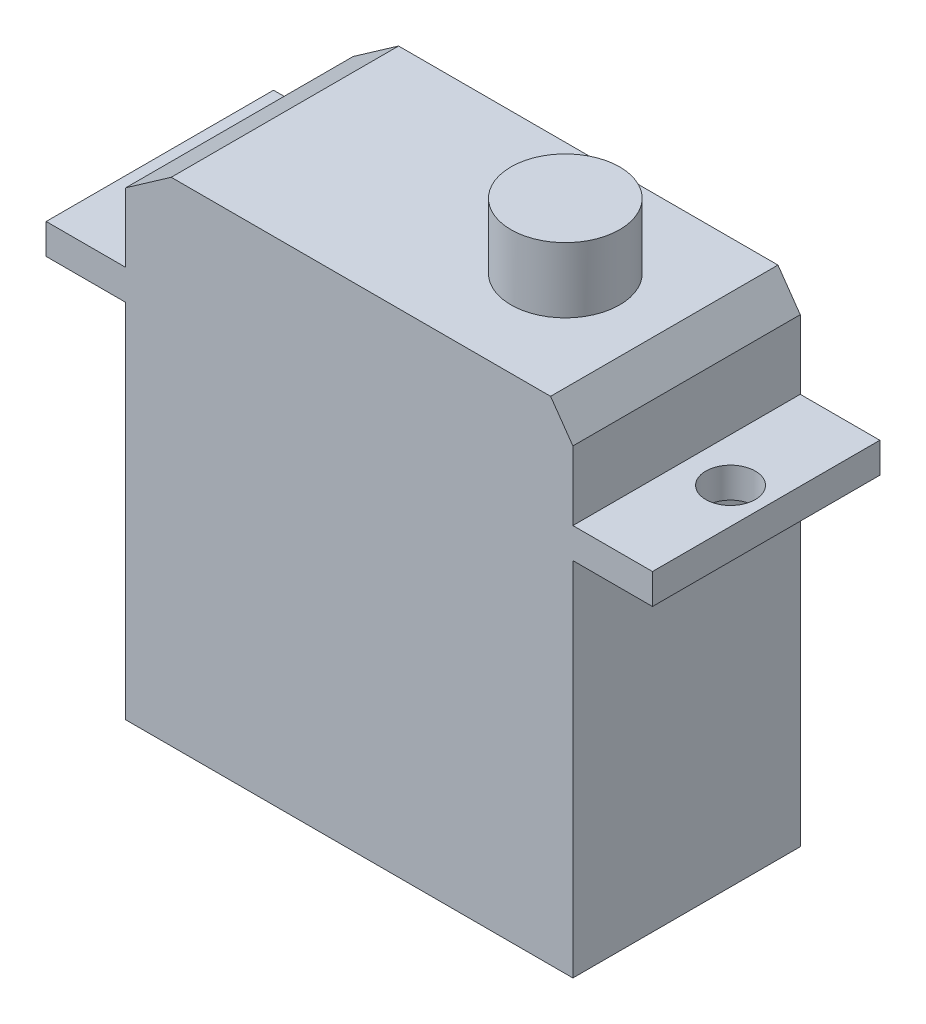
ISO-10303-21;
HEADER;
FILE_DESCRIPTION(('STEP AP214'),'2;1');
FILE_NAME('part.step','',(''),(''),'','','');
FILE_SCHEMA(('AUTOMOTIVE_DESIGN { 1 0 10303 214 1 1 1 1 }'));
ENDSEC;
DATA;
#1=APPLICATION_CONTEXT('core data for automotive mechanical design processes');
#2=APPLICATION_PROTOCOL_DEFINITION('international standard','automotive_design',2000,#1);
#3=PRODUCT_CONTEXT('',#1,'mechanical');
#4=PRODUCT('Part','Part','',(#3));
#5=PRODUCT_RELATED_PRODUCT_CATEGORY('part','',(#4));
#6=PRODUCT_DEFINITION_FORMATION('','',#4);
#7=PRODUCT_DEFINITION_CONTEXT('part definition',#1,'design');
#8=PRODUCT_DEFINITION('design','',#6,#7);
#9=PRODUCT_DEFINITION_SHAPE('','',#8);
#10=(LENGTH_UNIT() NAMED_UNIT(*) SI_UNIT(.MILLI.,.METRE.));
#11=(NAMED_UNIT(*) PLANE_ANGLE_UNIT() SI_UNIT($,.RADIAN.));
#12=(NAMED_UNIT(*) SI_UNIT($,.STERADIAN.) SOLID_ANGLE_UNIT());
#13=UNCERTAINTY_MEASURE_WITH_UNIT(LENGTH_MEASURE(1.E-05),#10,'distance_accuracy_value','');
#14=(GEOMETRIC_REPRESENTATION_CONTEXT(3) GLOBAL_UNCERTAINTY_ASSIGNED_CONTEXT((#13)) GLOBAL_UNIT_ASSIGNED_CONTEXT((#10,
#11,#12)) REPRESENTATION_CONTEXT('',''));
#15=CARTESIAN_POINT('',(0.,0.,0.));
#16=DIRECTION('',(0.,0.,1.));
#17=DIRECTION('',(1.,0.,0.));
#18=AXIS2_PLACEMENT_3D('',#15,#16,#17);
#19=CARTESIAN_POINT('',(20.,11.925,7.5));
#20=DIRECTION('',(0.,1.,0.));
#21=DIRECTION('',(0.,0.,1.));
#22=AXIS2_PLACEMENT_3D('',#19,#20,#21);
#23=PLANE('',#22);
#24=CARTESIAN_POINT('',(17.65,11.925,0.));
#25=DIRECTION('',(0.,1.,0.));
#26=DIRECTION('',(0.,0.,1.));
#27=AXIS2_PLACEMENT_3D('',#24,#25,#26);
#28=CIRCLE('',#27,1.63195);
#29=CARTESIAN_POINT('',(17.65,11.925,1.63194999999999));
#30=VERTEX_POINT('',#29);
#31=EDGE_CURVE('E313',#30,#30,#28,.T.);
#32=ORIENTED_EDGE('',*,*,#31,.T.);
#33=EDGE_LOOP('',(#32));
#34=FACE_BOUND('',#33,.T.);
#35=DIRECTION('',(1.,0.,0.));
#36=VECTOR('',#35,1.);
#37=CARTESIAN_POINT('',(20.,11.925,-7.5));
#38=LINE('',#37,#36);
#39=CARTESIAN_POINT('',(14.75,11.925,-7.5));
#40=VERTEX_POINT('',#39);
#41=CARTESIAN_POINT('',(20.,11.925,-7.5));
#42=VERTEX_POINT('',#41);
#43=EDGE_CURVE('E172',#40,#42,#38,.T.);
#44=ORIENTED_EDGE('',*,*,#43,.T.);
#45=DIRECTION('',(0.,0.,-1.));
#46=VECTOR('',#45,1.);
#47=CARTESIAN_POINT('',(20.,11.925,7.5));
#48=LINE('',#47,#46);
#49=CARTESIAN_POINT('',(20.,11.925,7.5));
#50=VERTEX_POINT('',#49);
#51=EDGE_CURVE('E47',#50,#42,#48,.T.);
#52=ORIENTED_EDGE('',*,*,#51,.F.);
#53=DIRECTION('',(1.,0.,0.));
#54=VECTOR('',#53,1.);
#55=CARTESIAN_POINT('',(20.,11.925,7.5));
#56=LINE('',#55,#54);
#57=CARTESIAN_POINT('',(14.75,11.925,7.5));
#58=VERTEX_POINT('',#57);
#59=EDGE_CURVE('E199',#58,#50,#56,.T.);
#60=ORIENTED_EDGE('',*,*,#59,.F.);
#61=DIRECTION('',(0.,0.,-1.));
#62=VECTOR('',#61,1.);
#63=CARTESIAN_POINT('',(14.75,11.925,7.5));
#64=LINE('',#63,#62);
#65=EDGE_CURVE('E168',#58,#40,#64,.T.);
#66=ORIENTED_EDGE('',*,*,#65,.T.);
#67=EDGE_LOOP('',(#44,#52,#60,#66));
#68=FACE_BOUND('',#67,.T.);
#69=ADVANCED_FACE('F38',(#34,#68),#23,.F.);
#70=CARTESIAN_POINT('',(20.,13.925,7.5));
#71=DIRECTION('',(-1.,0.,0.));
#72=DIRECTION('',(0.,0.,1.));
#73=AXIS2_PLACEMENT_3D('',#70,#71,#72);
#74=PLANE('',#73);
#75=DIRECTION('',(0.,1.,0.));
#76=VECTOR('',#75,1.);
#77=CARTESIAN_POINT('',(20.,13.925,-7.5));
#78=LINE('',#77,#76);
#79=CARTESIAN_POINT('',(20.,13.925,-7.5));
#80=VERTEX_POINT('',#79);
#81=EDGE_CURVE('E175',#42,#80,#78,.T.);
#82=ORIENTED_EDGE('',*,*,#81,.T.);
#83=DIRECTION('',(0.,0.,-1.));
#84=VECTOR('',#83,1.);
#85=CARTESIAN_POINT('',(20.,13.925,7.5));
#86=LINE('',#85,#84);
#87=CARTESIAN_POINT('',(20.,13.925,7.5));
#88=VERTEX_POINT('',#87);
#89=EDGE_CURVE('E227',#88,#80,#86,.T.);
#90=ORIENTED_EDGE('',*,*,#89,.F.);
#91=DIRECTION('',(0.,1.,0.));
#92=VECTOR('',#91,1.);
#93=CARTESIAN_POINT('',(20.,13.925,7.5));
#94=LINE('',#93,#92);
#95=EDGE_CURVE('E117',#50,#88,#94,.T.);
#96=ORIENTED_EDGE('',*,*,#95,.F.);
#97=ORIENTED_EDGE('',*,*,#51,.T.);
#98=EDGE_LOOP('',(#82,#90,#96,#97));
#99=FACE_BOUND('',#98,.T.);
#100=ADVANCED_FACE('F231',(#99),#74,.F.);
#101=CARTESIAN_POINT('',(14.75,13.925,7.5));
#102=DIRECTION('',(0.,-1.,0.));
#103=DIRECTION('',(0.,0.,-1.));
#104=AXIS2_PLACEMENT_3D('',#101,#102,#103);
#105=PLANE('',#104);
#106=CARTESIAN_POINT('',(17.65,13.925,0.));
#107=DIRECTION('',(0.,1.,0.));
#108=DIRECTION('',(0.,0.,1.));
#109=AXIS2_PLACEMENT_3D('',#106,#107,#108);
#110=CIRCLE('',#109,1.63195);
#111=CARTESIAN_POINT('',(17.65,13.925,1.63194999999999));
#112=VERTEX_POINT('',#111);
#113=EDGE_CURVE('E315',#112,#112,#110,.T.);
#114=ORIENTED_EDGE('',*,*,#113,.F.);
#115=EDGE_LOOP('',(#114));
#116=FACE_BOUND('',#115,.T.);
#117=DIRECTION('',(-1.,0.,0.));
#118=VECTOR('',#117,1.);
#119=CARTESIAN_POINT('',(14.75,13.925,-7.5));
#120=LINE('',#119,#118);
#121=CARTESIAN_POINT('',(14.75,13.925,-7.5));
#122=VERTEX_POINT('',#121);
#123=EDGE_CURVE('E178',#80,#122,#120,.T.);
#124=ORIENTED_EDGE('',*,*,#123,.T.);
#125=DIRECTION('',(0.,0.,-1.));
#126=VECTOR('',#125,1.);
#127=CARTESIAN_POINT('',(14.75,13.925,7.5));
#128=LINE('',#127,#126);
#129=CARTESIAN_POINT('',(14.75,13.925,7.5));
#130=VERTEX_POINT('',#129);
#131=EDGE_CURVE('E224',#130,#122,#128,.T.);
#132=ORIENTED_EDGE('',*,*,#131,.F.);
#133=DIRECTION('',(-1.,0.,0.));
#134=VECTOR('',#133,1.);
#135=CARTESIAN_POINT('',(14.75,13.925,7.5));
#136=LINE('',#135,#134);
#137=EDGE_CURVE('E251',#88,#130,#136,.T.);
#138=ORIENTED_EDGE('',*,*,#137,.F.);
#139=ORIENTED_EDGE('',*,*,#89,.T.);
#140=EDGE_LOOP('',(#124,#132,#138,#139));
#141=FACE_BOUND('',#140,.T.);
#142=ADVANCED_FACE('F242',(#116,#141),#105,.F.);
#143=CARTESIAN_POINT('',(14.75,18.4743773853709,7.5));
#144=DIRECTION('',(-1.,0.,0.));
#145=DIRECTION('',(0.,0.,1.));
#146=AXIS2_PLACEMENT_3D('',#143,#144,#145);
#147=PLANE('',#146);
#148=DIRECTION('',(0.,1.,0.));
#149=VECTOR('',#148,1.);
#150=CARTESIAN_POINT('',(14.75,18.4743773853709,-7.5));
#151=LINE('',#150,#149);
#152=CARTESIAN_POINT('',(14.75,18.4743773853709,-7.5));
#153=VERTEX_POINT('',#152);
#154=EDGE_CURVE('E180',#122,#153,#151,.T.);
#155=ORIENTED_EDGE('',*,*,#154,.T.);
#156=DIRECTION('',(0.,0.,-1.));
#157=VECTOR('',#156,1.);
#158=CARTESIAN_POINT('',(14.75,18.4743773853709,7.5));
#159=LINE('',#158,#157);
#160=CARTESIAN_POINT('',(14.75,18.4743773853709,7.5));
#161=VERTEX_POINT('',#160);
#162=EDGE_CURVE('E221',#161,#153,#159,.T.);
#163=ORIENTED_EDGE('',*,*,#162,.F.);
#164=DIRECTION('',(0.,1.,0.));
#165=VECTOR('',#164,1.);
#166=CARTESIAN_POINT('',(14.75,18.4743773853709,7.5));
#167=LINE('',#166,#165);
#168=EDGE_CURVE('E248',#130,#161,#167,.T.);
#169=ORIENTED_EDGE('',*,*,#168,.F.);
#170=ORIENTED_EDGE('',*,*,#131,.T.);
#171=EDGE_LOOP('',(#155,#163,#169,#170));
#172=FACE_BOUND('',#171,.T.);
#173=ADVANCED_FACE('F246',(#172),#147,.F.);
#174=CARTESIAN_POINT('',(13.2791282103029,20.575,7.5));
#175=DIRECTION('',(-0.819152044288992,-0.573576436351045,0.));
#176=DIRECTION('',(0.573576436351045,-0.819152044288993,0.));
#177=AXIS2_PLACEMENT_3D('',#174,#175,#176);
#178=PLANE('',#177);
#179=DIRECTION('',(-0.573576436351045,0.819152044288992,0.));
#180=VECTOR('',#179,1.);
#181=CARTESIAN_POINT('',(13.2791282103029,20.575,-7.5));
#182=LINE('',#181,#180);
#183=CARTESIAN_POINT('',(13.2791282103029,20.575,-7.5));
#184=VERTEX_POINT('',#183);
#185=EDGE_CURVE('E182',#153,#184,#182,.T.);
#186=ORIENTED_EDGE('',*,*,#185,.T.);
#187=DIRECTION('',(0.,0.,-1.));
#188=VECTOR('',#187,1.);
#189=CARTESIAN_POINT('',(13.2791282103029,20.575,7.5));
#190=LINE('',#189,#188);
#191=CARTESIAN_POINT('',(13.2791282103029,20.575,7.5));
#192=VERTEX_POINT('',#191);
#193=EDGE_CURVE('E218',#192,#184,#190,.T.);
#194=ORIENTED_EDGE('',*,*,#193,.F.);
#195=DIRECTION('',(-0.573576436351045,0.819152044288992,0.));
#196=VECTOR('',#195,1.);
#197=CARTESIAN_POINT('',(13.2791282103029,20.575,7.5));
#198=LINE('',#197,#196);
#199=EDGE_CURVE('E250',#161,#192,#198,.T.);
#200=ORIENTED_EDGE('',*,*,#199,.F.);
#201=ORIENTED_EDGE('',*,*,#162,.T.);
#202=EDGE_LOOP('',(#186,#194,#200,#201));
#203=FACE_BOUND('',#202,.T.);
#204=ADVANCED_FACE('F296',(#203),#178,.F.);
#205=CARTESIAN_POINT('',(-11.75,20.575,7.5));
#206=DIRECTION('',(0.,-1.,0.));
#207=DIRECTION('',(0.,0.,-1.));
#208=AXIS2_PLACEMENT_3D('',#205,#206,#207);
#209=PLANE('',#208);
#210=CARTESIAN_POINT('',(6.75000000000001,20.575,0.));
#211=DIRECTION('',(0.,-1.,0.));
#212=DIRECTION('',(0.,0.,-1.));
#213=AXIS2_PLACEMENT_3D('',#210,#211,#212);
#214=CIRCLE('',#213,3.587141306582);
#215=CARTESIAN_POINT('',(6.75000000000001,20.575,-3.587141306582));
#216=VERTEX_POINT('',#215);
#217=EDGE_CURVE('E11',#216,#216,#214,.F.);
#218=ORIENTED_EDGE('',*,*,#217,.F.);
#219=EDGE_LOOP('',(#218));
#220=FACE_BOUND('',#219,.T.);
#221=DIRECTION('',(-1.,0.,0.));
#222=VECTOR('',#221,1.);
#223=CARTESIAN_POINT('',(-11.75,20.575,-7.5));
#224=LINE('',#223,#222);
#225=CARTESIAN_POINT('',(-11.75,20.575,-7.5));
#226=VERTEX_POINT('',#225);
#227=EDGE_CURVE('E184',#184,#226,#224,.T.);
#228=ORIENTED_EDGE('',*,*,#227,.T.);
#229=DIRECTION('',(0.,0.,-1.));
#230=VECTOR('',#229,1.);
#231=CARTESIAN_POINT('',(-11.75,20.575,7.5));
#232=LINE('',#231,#230);
#233=CARTESIAN_POINT('',(-11.75,20.575,7.5));
#234=VERTEX_POINT('',#233);
#235=EDGE_CURVE('E215',#234,#226,#232,.T.);
#236=ORIENTED_EDGE('',*,*,#235,.F.);
#237=DIRECTION('',(-1.,0.,0.));
#238=VECTOR('',#237,1.);
#239=CARTESIAN_POINT('',(-11.75,20.575,7.5));
#240=LINE('',#239,#238);
#241=EDGE_CURVE('E253',#192,#234,#240,.T.);
#242=ORIENTED_EDGE('',*,*,#241,.F.);
#243=ORIENTED_EDGE('',*,*,#193,.T.);
#244=EDGE_LOOP('',(#228,#236,#242,#243));
#245=FACE_BOUND('',#244,.T.);
#246=ADVANCED_FACE('F292',(#220,#245),#209,.F.);
#247=CARTESIAN_POINT('',(-14.75,18.4743773853709,7.5));
#248=DIRECTION('',(0.573576436351045,-0.819152044288992,0.));
#249=DIRECTION('',(0.819152044288993,0.573576436351045,0.));
#250=AXIS2_PLACEMENT_3D('',#247,#248,#249);
#251=PLANE('',#250);
#252=DIRECTION('',(-0.819152044288992,-0.573576436351045,0.));
#253=VECTOR('',#252,1.);
#254=CARTESIAN_POINT('',(-14.75,18.4743773853709,-7.5));
#255=LINE('',#254,#253);
#256=CARTESIAN_POINT('',(-14.75,18.4743773853709,-7.5));
#257=VERTEX_POINT('',#256);
#258=EDGE_CURVE('E186',#226,#257,#255,.T.);
#259=ORIENTED_EDGE('',*,*,#258,.T.);
#260=DIRECTION('',(0.,0.,-1.));
#261=VECTOR('',#260,1.);
#262=CARTESIAN_POINT('',(-14.75,18.4743773853709,7.5));
#263=LINE('',#262,#261);
#264=CARTESIAN_POINT('',(-14.75,18.4743773853709,7.5));
#265=VERTEX_POINT('',#264);
#266=EDGE_CURVE('E212',#265,#257,#263,.T.);
#267=ORIENTED_EDGE('',*,*,#266,.F.);
#268=DIRECTION('',(-0.819152044288992,-0.573576436351045,0.));
#269=VECTOR('',#268,1.);
#270=CARTESIAN_POINT('',(-14.75,18.4743773853709,7.5));
#271=LINE('',#270,#269);
#272=EDGE_CURVE('E259',#234,#265,#271,.T.);
#273=ORIENTED_EDGE('',*,*,#272,.F.);
#274=ORIENTED_EDGE('',*,*,#235,.T.);
#275=EDGE_LOOP('',(#259,#267,#273,#274));
#276=FACE_BOUND('',#275,.T.);
#277=ADVANCED_FACE('F288',(#276),#251,.F.);
#278=CARTESIAN_POINT('',(-14.75,13.925,7.5));
#279=DIRECTION('',(1.,0.,0.));
#280=DIRECTION('',(0.,0.,-1.));
#281=AXIS2_PLACEMENT_3D('',#278,#279,#280);
#282=PLANE('',#281);
#283=DIRECTION('',(0.,-1.,0.));
#284=VECTOR('',#283,1.);
#285=CARTESIAN_POINT('',(-14.75,13.925,-7.5));
#286=LINE('',#285,#284);
#287=CARTESIAN_POINT('',(-14.75,13.925,-7.5));
#288=VERTEX_POINT('',#287);
#289=EDGE_CURVE('E188',#257,#288,#286,.T.);
#290=ORIENTED_EDGE('',*,*,#289,.T.);
#291=DIRECTION('',(0.,0.,-1.));
#292=VECTOR('',#291,1.);
#293=CARTESIAN_POINT('',(-14.75,13.925,7.5));
#294=LINE('',#293,#292);
#295=CARTESIAN_POINT('',(-14.75,13.925,7.5));
#296=VERTEX_POINT('',#295);
#297=EDGE_CURVE('E209',#296,#288,#294,.T.);
#298=ORIENTED_EDGE('',*,*,#297,.F.);
#299=DIRECTION('',(0.,-1.,0.));
#300=VECTOR('',#299,1.);
#301=CARTESIAN_POINT('',(-14.75,13.925,7.5));
#302=LINE('',#301,#300);
#303=EDGE_CURVE('E261',#265,#296,#302,.T.);
#304=ORIENTED_EDGE('',*,*,#303,.F.);
#305=ORIENTED_EDGE('',*,*,#266,.T.);
#306=EDGE_LOOP('',(#290,#298,#304,#305));
#307=FACE_BOUND('',#306,.T.);
#308=ADVANCED_FACE('F284',(#307),#282,.F.);
#309=CARTESIAN_POINT('',(-20.,13.925,7.5));
#310=DIRECTION('',(0.,-1.,0.));
#311=DIRECTION('',(0.,0.,-1.));
#312=AXIS2_PLACEMENT_3D('',#309,#310,#311);
#313=PLANE('',#312);
#314=CARTESIAN_POINT('',(-17.65,13.925,0.));
#315=DIRECTION('',(0.,1.,0.));
#316=DIRECTION('',(0.,0.,1.));
#317=AXIS2_PLACEMENT_3D('',#314,#315,#316);
#318=CIRCLE('',#317,1.63195);
#319=CARTESIAN_POINT('',(-17.65,13.925,1.63195));
#320=VERTEX_POINT('',#319);
#321=EDGE_CURVE('E323',#320,#320,#318,.T.);
#322=ORIENTED_EDGE('',*,*,#321,.F.);
#323=EDGE_LOOP('',(#322));
#324=FACE_BOUND('',#323,.T.);
#325=DIRECTION('',(-1.,0.,0.));
#326=VECTOR('',#325,1.);
#327=CARTESIAN_POINT('',(-20.,13.925,-7.5));
#328=LINE('',#327,#326);
#329=CARTESIAN_POINT('',(-20.,13.925,-7.5));
#330=VERTEX_POINT('',#329);
#331=EDGE_CURVE('E190',#288,#330,#328,.T.);
#332=ORIENTED_EDGE('',*,*,#331,.T.);
#333=DIRECTION('',(0.,0.,-1.));
#334=VECTOR('',#333,1.);
#335=CARTESIAN_POINT('',(-20.,13.925,7.5));
#336=LINE('',#335,#334);
#337=CARTESIAN_POINT('',(-20.,13.925,7.5));
#338=VERTEX_POINT('',#337);
#339=EDGE_CURVE('E206',#338,#330,#336,.T.);
#340=ORIENTED_EDGE('',*,*,#339,.F.);
#341=DIRECTION('',(-1.,0.,0.));
#342=VECTOR('',#341,1.);
#343=CARTESIAN_POINT('',(-20.,13.925,7.5));
#344=LINE('',#343,#342);
#345=EDGE_CURVE('E263',#296,#338,#344,.T.);
#346=ORIENTED_EDGE('',*,*,#345,.F.);
#347=ORIENTED_EDGE('',*,*,#297,.T.);
#348=EDGE_LOOP('',(#332,#340,#346,#347));
#349=FACE_BOUND('',#348,.T.);
#350=ADVANCED_FACE('F280',(#324,#349),#313,.F.);
#351=CARTESIAN_POINT('',(-20.,11.925,7.5));
#352=DIRECTION('',(1.,0.,0.));
#353=DIRECTION('',(0.,0.,-1.));
#354=AXIS2_PLACEMENT_3D('',#351,#352,#353);
#355=PLANE('',#354);
#356=DIRECTION('',(0.,-1.,0.));
#357=VECTOR('',#356,1.);
#358=CARTESIAN_POINT('',(-20.,11.925,-7.5));
#359=LINE('',#358,#357);
#360=CARTESIAN_POINT('',(-20.,11.925,-7.5));
#361=VERTEX_POINT('',#360);
#362=EDGE_CURVE('E192',#330,#361,#359,.T.);
#363=ORIENTED_EDGE('',*,*,#362,.T.);
#364=DIRECTION('',(0.,0.,-1.));
#365=VECTOR('',#364,1.);
#366=CARTESIAN_POINT('',(-20.,11.925,7.5));
#367=LINE('',#366,#365);
#368=CARTESIAN_POINT('',(-20.,11.925,7.5));
#369=VERTEX_POINT('',#368);
#370=EDGE_CURVE('E203',#369,#361,#367,.T.);
#371=ORIENTED_EDGE('',*,*,#370,.F.);
#372=DIRECTION('',(0.,-1.,0.));
#373=VECTOR('',#372,1.);
#374=CARTESIAN_POINT('',(-20.,11.925,7.5));
#375=LINE('',#374,#373);
#376=EDGE_CURVE('E265',#338,#369,#375,.T.);
#377=ORIENTED_EDGE('',*,*,#376,.F.);
#378=ORIENTED_EDGE('',*,*,#339,.T.);
#379=EDGE_LOOP('',(#363,#371,#377,#378));
#380=FACE_BOUND('',#379,.T.);
#381=ADVANCED_FACE('F271',(#380),#355,.F.);
#382=CARTESIAN_POINT('',(-14.75,11.925,7.5));
#383=DIRECTION('',(0.,1.,0.));
#384=DIRECTION('',(-1.,0.,0.));
#385=AXIS2_PLACEMENT_3D('',#382,#383,#384);
#386=PLANE('',#385);
#387=CARTESIAN_POINT('',(-17.65,11.925,0.));
#388=DIRECTION('',(0.,1.,0.));
#389=DIRECTION('',(-1.,0.,0.));
#390=AXIS2_PLACEMENT_3D('',#387,#388,#389);
#391=CIRCLE('',#390,1.63195);
#392=CARTESIAN_POINT('',(-19.28195,11.925,0.));
#393=VERTEX_POINT('',#392);
#394=EDGE_CURVE('E41',#393,#393,#391,.T.);
#395=ORIENTED_EDGE('',*,*,#394,.T.);
#396=EDGE_LOOP('',(#395));
#397=FACE_BOUND('',#396,.T.);
#398=DIRECTION('',(1.,0.,0.));
#399=VECTOR('',#398,1.);
#400=CARTESIAN_POINT('',(-14.75,11.925,-7.5));
#401=LINE('',#400,#399);
#402=CARTESIAN_POINT('',(-14.75,11.925,-7.5));
#403=VERTEX_POINT('',#402);
#404=EDGE_CURVE('E194',#361,#403,#401,.T.);
#405=ORIENTED_EDGE('',*,*,#404,.T.);
#406=DIRECTION('',(0.,0.,-1.));
#407=VECTOR('',#406,1.);
#408=CARTESIAN_POINT('',(-14.75,11.925,7.5));
#409=LINE('',#408,#407);
#410=CARTESIAN_POINT('',(-14.75,11.925,7.5));
#411=VERTEX_POINT('',#410);
#412=EDGE_CURVE('E163',#411,#403,#409,.T.);
#413=ORIENTED_EDGE('',*,*,#412,.F.);
#414=DIRECTION('',(1.,0.,0.));
#415=VECTOR('',#414,1.);
#416=CARTESIAN_POINT('',(-14.75,11.925,7.5));
#417=LINE('',#416,#415);
#418=EDGE_CURVE('E154',#369,#411,#417,.T.);
#419=ORIENTED_EDGE('',*,*,#418,.F.);
#420=ORIENTED_EDGE('',*,*,#370,.T.);
#421=EDGE_LOOP('',(#405,#413,#419,#420));
#422=FACE_BOUND('',#421,.T.);
#423=ADVANCED_FACE('F275',(#397,#422),#386,.F.);
#424=CARTESIAN_POINT('',(-14.75,-11.925,7.5));
#425=DIRECTION('',(1.,0.,0.));
#426=DIRECTION('',(0.,0.,-1.));
#427=AXIS2_PLACEMENT_3D('',#424,#425,#426);
#428=PLANE('',#427);
#429=DIRECTION('',(0.,-1.,0.));
#430=VECTOR('',#429,1.);
#431=CARTESIAN_POINT('',(-14.75,-11.925,-7.5));
#432=LINE('',#431,#430);
#433=CARTESIAN_POINT('',(-14.75,-11.925,-7.5));
#434=VERTEX_POINT('',#433);
#435=EDGE_CURVE('E162',#403,#434,#432,.T.);
#436=ORIENTED_EDGE('',*,*,#435,.T.);
#437=DIRECTION('',(0.,0.,-1.));
#438=VECTOR('',#437,1.);
#439=CARTESIAN_POINT('',(-14.75,-11.925,7.5));
#440=LINE('',#439,#438);
#441=CARTESIAN_POINT('',(-14.75,-11.925,7.5));
#442=VERTEX_POINT('',#441);
#443=EDGE_CURVE('E159',#442,#434,#440,.T.);
#444=ORIENTED_EDGE('',*,*,#443,.F.);
#445=DIRECTION('',(0.,-1.,0.));
#446=VECTOR('',#445,1.);
#447=CARTESIAN_POINT('',(-14.75,-11.925,7.5));
#448=LINE('',#447,#446);
#449=EDGE_CURVE('E148',#411,#442,#448,.T.);
#450=ORIENTED_EDGE('',*,*,#449,.F.);
#451=ORIENTED_EDGE('',*,*,#412,.T.);
#452=EDGE_LOOP('',(#436,#444,#450,#451));
#453=FACE_BOUND('',#452,.T.);
#454=ADVANCED_FACE('F160',(#453),#428,.F.);
#455=CARTESIAN_POINT('',(-14.75,-11.925,7.5));
#456=DIRECTION('',(0.,1.,0.));
#457=DIRECTION('',(0.,0.,1.));
#458=AXIS2_PLACEMENT_3D('',#455,#456,#457);
#459=PLANE('',#458);
#460=DIRECTION('',(1.,0.,0.));
#461=VECTOR('',#460,1.);
#462=CARTESIAN_POINT('',(-14.75,-11.925,-7.5));
#463=LINE('',#462,#461);
#464=CARTESIAN_POINT('',(14.75,-11.925,-7.5));
#465=VERTEX_POINT('',#464);
#466=EDGE_CURVE('E102',#434,#465,#463,.T.);
#467=ORIENTED_EDGE('',*,*,#466,.T.);
#468=DIRECTION('',(0.,0.,-1.));
#469=VECTOR('',#468,1.);
#470=CARTESIAN_POINT('',(14.75,-11.925,7.5));
#471=LINE('',#470,#469);
#472=CARTESIAN_POINT('',(14.75,-11.925,7.5));
#473=VERTEX_POINT('',#472);
#474=EDGE_CURVE('E164',#473,#465,#471,.T.);
#475=ORIENTED_EDGE('',*,*,#474,.F.);
#476=DIRECTION('',(1.,0.,0.));
#477=VECTOR('',#476,1.);
#478=CARTESIAN_POINT('',(-14.75,-11.925,7.5));
#479=LINE('',#478,#477);
#480=EDGE_CURVE('E152',#442,#473,#479,.T.);
#481=ORIENTED_EDGE('',*,*,#480,.F.);
#482=ORIENTED_EDGE('',*,*,#443,.T.);
#483=EDGE_LOOP('',(#467,#475,#481,#482));
#484=FACE_BOUND('',#483,.T.);
#485=ADVANCED_FACE('F166',(#484),#459,.F.);
#486=CARTESIAN_POINT('',(14.75,-11.925,7.5));
#487=DIRECTION('',(-1.,0.,0.));
#488=DIRECTION('',(0.,0.,1.));
#489=AXIS2_PLACEMENT_3D('',#486,#487,#488);
#490=PLANE('',#489);
#491=DIRECTION('',(0.,1.,0.));
#492=VECTOR('',#491,1.);
#493=CARTESIAN_POINT('',(14.75,-11.925,-7.5));
#494=LINE('',#493,#492);
#495=EDGE_CURVE('E108',#465,#40,#494,.T.);
#496=ORIENTED_EDGE('',*,*,#495,.T.);
#497=ORIENTED_EDGE('',*,*,#65,.F.);
#498=DIRECTION('',(0.,1.,0.));
#499=VECTOR('',#498,1.);
#500=CARTESIAN_POINT('',(14.75,-11.925,7.5));
#501=LINE('',#500,#499);
#502=EDGE_CURVE('E55',#473,#58,#501,.T.);
#503=ORIENTED_EDGE('',*,*,#502,.F.);
#504=ORIENTED_EDGE('',*,*,#474,.T.);
#505=EDGE_LOOP('',(#496,#497,#503,#504));
#506=FACE_BOUND('',#505,.T.);
#507=ADVANCED_FACE('F351',(#506),#490,.F.);
#508=CARTESIAN_POINT('',(0.,0.,7.5));
#509=DIRECTION('',(0.,0.,-1.));
#510=DIRECTION('',(-1.,0.,0.));
#511=AXIS2_PLACEMENT_3D('',#508,#509,#510);
#512=PLANE('',#511);
#513=ORIENTED_EDGE('',*,*,#59,.T.);
#514=ORIENTED_EDGE('',*,*,#95,.T.);
#515=ORIENTED_EDGE('',*,*,#137,.T.);
#516=ORIENTED_EDGE('',*,*,#168,.T.);
#517=ORIENTED_EDGE('',*,*,#199,.T.);
#518=ORIENTED_EDGE('',*,*,#241,.T.);
#519=ORIENTED_EDGE('',*,*,#272,.T.);
#520=ORIENTED_EDGE('',*,*,#303,.T.);
#521=ORIENTED_EDGE('',*,*,#345,.T.);
#522=ORIENTED_EDGE('',*,*,#376,.T.);
#523=ORIENTED_EDGE('',*,*,#418,.T.);
#524=ORIENTED_EDGE('',*,*,#449,.T.);
#525=ORIENTED_EDGE('',*,*,#480,.T.);
#526=ORIENTED_EDGE('',*,*,#502,.T.);
#527=EDGE_LOOP('',(#513,#514,#515,#516,#517,#518,#519,#520,#521,#522,#523,#524,#525,#526));
#528=FACE_BOUND('',#527,.T.);
#529=ADVANCED_FACE('F150',(#528),#512,.F.);
#530=CARTESIAN_POINT('',(0.,0.,-7.5));
#531=DIRECTION('',(0.,0.,-1.));
#532=DIRECTION('',(-1.,0.,0.));
#533=AXIS2_PLACEMENT_3D('',#530,#531,#532);
#534=PLANE('',#533);
#535=ORIENTED_EDGE('',*,*,#43,.F.);
#536=ORIENTED_EDGE('',*,*,#495,.F.);
#537=ORIENTED_EDGE('',*,*,#466,.F.);
#538=ORIENTED_EDGE('',*,*,#435,.F.);
#539=ORIENTED_EDGE('',*,*,#404,.F.);
#540=ORIENTED_EDGE('',*,*,#362,.F.);
#541=ORIENTED_EDGE('',*,*,#331,.F.);
#542=ORIENTED_EDGE('',*,*,#289,.F.);
#543=ORIENTED_EDGE('',*,*,#258,.F.);
#544=ORIENTED_EDGE('',*,*,#227,.F.);
#545=ORIENTED_EDGE('',*,*,#185,.F.);
#546=ORIENTED_EDGE('',*,*,#154,.F.);
#547=ORIENTED_EDGE('',*,*,#123,.F.);
#548=ORIENTED_EDGE('',*,*,#81,.F.);
#549=EDGE_LOOP('',(#535,#536,#537,#538,#539,#540,#541,#542,#543,#544,#545,#546,#547,#548));
#550=FACE_BOUND('',#549,.T.);
#551=ADVANCED_FACE('F236',(#550),#534,.T.);
#552=CARTESIAN_POINT('',(6.75000000000001,24.875,0.));
#553=DIRECTION('',(0.,-1.,0.));
#554=DIRECTION('',(0.,0.,-1.));
#555=AXIS2_PLACEMENT_3D('',#552,#553,#554);
#556=CYLINDRICAL_SURFACE('',#555,3.587141306582);
#557=CARTESIAN_POINT('',(6.75000000000001,24.875,0.));
#558=DIRECTION('',(0.,1.,0.));
#559=DIRECTION('',(0.,0.,1.));
#560=AXIS2_PLACEMENT_3D('',#557,#558,#559);
#561=CIRCLE('',#560,3.587141306582);
#562=CARTESIAN_POINT('',(6.75000000000001,24.875,3.587141306582));
#563=VERTEX_POINT('',#562);
#564=EDGE_CURVE('E176',#563,#563,#561,.T.);
#565=ORIENTED_EDGE('',*,*,#564,.F.);
#566=EDGE_LOOP('',(#565));
#567=FACE_BOUND('',#566,.T.);
#568=ORIENTED_EDGE('',*,*,#217,.T.);
#569=EDGE_LOOP('',(#568));
#570=FACE_BOUND('',#569,.T.);
#571=ADVANCED_FACE('F344',(#567,#570),#556,.T.);
#572=CARTESIAN_POINT('',(6.75000000000001,24.875,0.));
#573=DIRECTION('',(0.,1.,0.));
#574=DIRECTION('',(0.,0.,1.));
#575=AXIS2_PLACEMENT_3D('',#572,#573,#574);
#576=PLANE('',#575);
#577=ORIENTED_EDGE('',*,*,#564,.T.);
#578=EDGE_LOOP('',(#577));
#579=FACE_BOUND('',#578,.T.);
#580=ADVANCED_FACE('F338',(#579),#576,.T.);
#581=CARTESIAN_POINT('',(17.65,13.925,0.));
#582=DIRECTION('',(0.,1.,0.));
#583=DIRECTION('',(0.,0.,1.));
#584=AXIS2_PLACEMENT_3D('',#581,#582,#583);
#585=CYLINDRICAL_SURFACE('',#584,1.63195);
#586=ORIENTED_EDGE('',*,*,#113,.T.);
#587=EDGE_LOOP('',(#586));
#588=FACE_BOUND('',#587,.T.);
#589=ORIENTED_EDGE('',*,*,#31,.F.);
#590=EDGE_LOOP('',(#589));
#591=FACE_BOUND('',#590,.T.);
#592=ADVANCED_FACE('F333',(#588,#591),#585,.F.);
#593=CARTESIAN_POINT('',(-17.65,13.925,0.));
#594=DIRECTION('',(0.,1.,0.));
#595=DIRECTION('',(0.,0.,1.));
#596=AXIS2_PLACEMENT_3D('',#593,#594,#595);
#597=CYLINDRICAL_SURFACE('',#596,1.63195);
#598=ORIENTED_EDGE('',*,*,#321,.T.);
#599=EDGE_LOOP('',(#598));
#600=FACE_BOUND('',#599,.T.);
#601=ORIENTED_EDGE('',*,*,#394,.F.);
#602=EDGE_LOOP('',(#601));
#603=FACE_BOUND('',#602,.T.);
#604=ADVANCED_FACE('F331',(#600,#603),#597,.F.);
#605=CLOSED_SHELL('',(#69,#100,#142,#173,#204,#246,#277,#308,#350,#381,#423,#454,#485,#507,#529,
#551,#571,#580,#592,#604));
#606=MANIFOLD_SOLID_BREP('B2',#605);
#607=ADVANCED_BREP_SHAPE_REPRESENTATION('',(#18,#606),#14);
#608=SHAPE_DEFINITION_REPRESENTATION(#9,#607);
ENDSEC;
END-ISO-10303-21;
